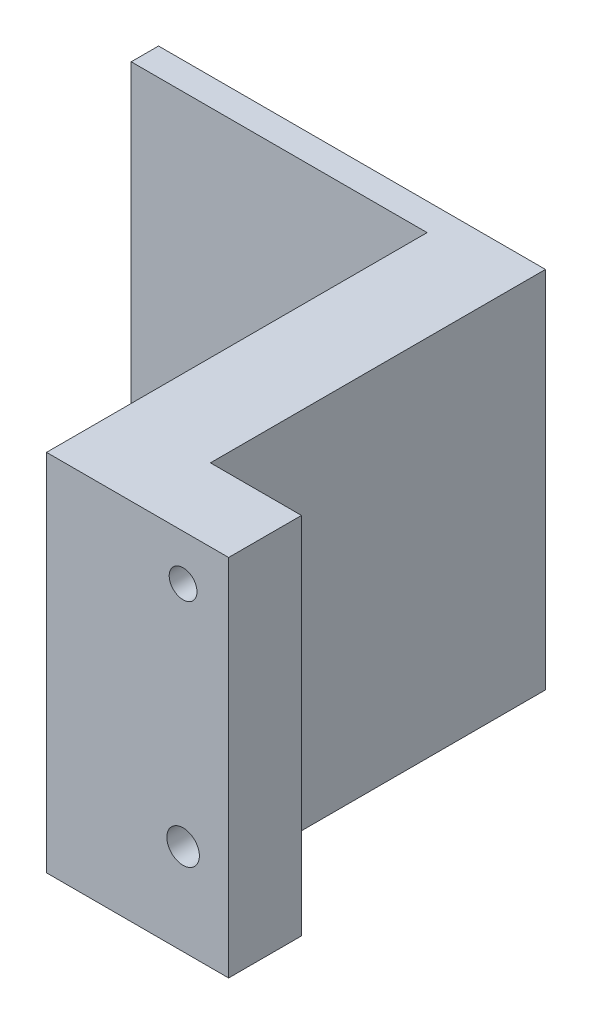
ISO-10303-21;
HEADER;
FILE_DESCRIPTION(('STEP AP214'),'2;1');
FILE_NAME('part.step','',(''),(''),'','','');
FILE_SCHEMA(('AUTOMOTIVE_DESIGN { 1 0 10303 214 1 1 1 1 }'));
ENDSEC;
DATA;
#1=APPLICATION_CONTEXT('core data for automotive mechanical design processes');
#2=APPLICATION_PROTOCOL_DEFINITION('international standard','automotive_design',2000,#1);
#3=PRODUCT_CONTEXT('',#1,'mechanical');
#4=PRODUCT('Part','Part','',(#3));
#5=PRODUCT_RELATED_PRODUCT_CATEGORY('part','',(#4));
#6=PRODUCT_DEFINITION_FORMATION('','',#4);
#7=PRODUCT_DEFINITION_CONTEXT('part definition',#1,'design');
#8=PRODUCT_DEFINITION('design','',#6,#7);
#9=PRODUCT_DEFINITION_SHAPE('','',#8);
#10=(LENGTH_UNIT() NAMED_UNIT(*) SI_UNIT(.MILLI.,.METRE.));
#11=(NAMED_UNIT(*) PLANE_ANGLE_UNIT() SI_UNIT($,.RADIAN.));
#12=(NAMED_UNIT(*) SI_UNIT($,.STERADIAN.) SOLID_ANGLE_UNIT());
#13=UNCERTAINTY_MEASURE_WITH_UNIT(LENGTH_MEASURE(1.E-05),#10,'distance_accuracy_value','');
#14=(GEOMETRIC_REPRESENTATION_CONTEXT(3) GLOBAL_UNCERTAINTY_ASSIGNED_CONTEXT((#13)) GLOBAL_UNIT_ASSIGNED_CONTEXT((#10,
#11,#12)) REPRESENTATION_CONTEXT('',''));
#15=CARTESIAN_POINT('',(0.,0.,0.));
#16=DIRECTION('',(0.,0.,1.));
#17=DIRECTION('',(1.,0.,0.));
#18=AXIS2_PLACEMENT_3D('',#15,#16,#17);
#19=CARTESIAN_POINT('',(0.,0.,0.));
#20=DIRECTION('',(0.,0.,1.));
#21=DIRECTION('',(1.,0.,0.));
#22=AXIS2_PLACEMENT_3D('',#19,#20,#21);
#23=PLANE('',#22);
#24=CARTESIAN_POINT('',(49.9189017309724,2.44231125671822,0.));
#25=DIRECTION('',(0.,0.,1.));
#26=DIRECTION('',(1.,0.,0.));
#27=AXIS2_PLACEMENT_3D('',#24,#25,#26);
#28=CIRCLE('',#27,1.78642085354791);
#29=CARTESIAN_POINT('',(51.7053225845203,2.44231125671822,0.));
#30=VERTEX_POINT('',#29);
#31=EDGE_CURVE('E436',#30,#30,#28,.T.);
#32=ORIENTED_EDGE('',*,*,#31,.T.);
#33=EDGE_LOOP('',(#32));
#34=FACE_BOUND('',#33,.T.);
#35=DIRECTION('',(-0.999940069087134,0.0109479785356853,0.));
#36=VECTOR('',#35,1.);
#37=CARTESIAN_POINT('',(0.0655638957736576,5.98831704463414,0.));
#38=LINE('',#37,#36);
#39=CARTESIAN_POINT('',(51.6836926707623,5.42316900891564,0.));
#40=VERTEX_POINT('',#39);
#41=CARTESIAN_POINT('',(48.2197986623966,5.4610939190436,0.));
#42=VERTEX_POINT('',#41);
#43=EDGE_CURVE('E285',#40,#42,#38,.T.);
#44=ORIENTED_EDGE('',*,*,#43,.F.);
#45=DIRECTION('',(-0.490488807011577,0.871447491359267,0.));
#46=VECTOR('',#45,1.);
#47=CARTESIAN_POINT('',(41.5677211763847,23.3961336421925,0.));
#48=LINE('',#47,#46);
#49=CARTESIAN_POINT('',(53.3827957393381,2.40438634659025,0.));
#50=VERTEX_POINT('',#49);
#51=EDGE_CURVE('E340',#50,#40,#48,.T.);
#52=ORIENTED_EDGE('',*,*,#51,.F.);
#53=DIRECTION('',(0.509451262075557,0.860499512823582,0.));
#54=VECTOR('',#53,1.);
#55=CARTESIAN_POINT('',(38.4737524724558,-22.7780509596798,0.));
#56=LINE('',#55,#54);
#57=CARTESIAN_POINT('',(51.6180047995482,-0.576471405607153,0.));
#58=VERTEX_POINT('',#57);
#59=EDGE_CURVE('E344',#58,#50,#56,.T.);
#60=ORIENTED_EDGE('',*,*,#59,.F.);
#61=DIRECTION('',(0.999940069087134,-0.010947978535685,0.));
#62=VECTOR('',#61,1.);
#63=CARTESIAN_POINT('',(-0.000123975440454096,-0.0113233698886696,0.));
#64=LINE('',#63,#62);
#65=CARTESIAN_POINT('',(48.1541107911825,-0.538546495479193,0.));
#66=VERTEX_POINT('',#65);
#67=EDGE_CURVE('E348',#66,#58,#64,.T.);
#68=ORIENTED_EDGE('',*,*,#67,.F.);
#69=DIRECTION('',(0.490488807011576,-0.871447491359268,0.));
#70=VECTOR('',#69,1.);
#71=CARTESIAN_POINT('',(36.3390362282292,20.453200800123,0.));
#72=LINE('',#71,#70);
#73=CARTESIAN_POINT('',(46.4550077226067,2.48023616684618,0.));
#74=VERTEX_POINT('',#73);
#75=EDGE_CURVE('E352',#74,#66,#72,.T.);
#76=ORIENTED_EDGE('',*,*,#75,.F.);
#77=DIRECTION('',(-0.509451262075557,-0.860499512823582,0.));
#78=VECTOR('',#77,1.);
#79=CARTESIAN_POINT('',(33.3107553955144,-19.7213433872265,0.));
#80=LINE('',#79,#78);
#81=EDGE_CURVE('E356',#42,#74,#80,.T.);
#82=ORIENTED_EDGE('',*,*,#81,.F.);
#83=EDGE_LOOP('',(#44,#52,#60,#68,#76,#82));
#84=FACE_BOUND('',#83,.T.);
#85=ADVANCED_FACE('F95',(#34,#84),#23,.F.);
#86=CARTESIAN_POINT('',(49.9189017309724,27.4423112567182,0.));
#87=DIRECTION('',(0.,0.,1.));
#88=DIRECTION('',(1.,0.,0.));
#89=AXIS2_PLACEMENT_3D('',#86,#87,#88);
#90=CIRCLE('',#89,1.52492957047442);
#91=CARTESIAN_POINT('',(51.4438313014468,27.4423112567182,0.));
#92=VERTEX_POINT('',#91);
#93=EDGE_CURVE('E451',#92,#92,#90,.T.);
#94=ORIENTED_EDGE('',*,*,#93,.T.);
#95=EDGE_LOOP('',(#94));
#96=FACE_BOUND('',#95,.T.);
#97=DIRECTION('',(-0.999940069087134,-0.0109479785356923,0.));
#98=VECTOR('',#97,1.);
#99=CARTESIAN_POINT('',(-0.327280573296135,29.892363965246,0.));
#100=LINE('',#99,#98);
#101=CARTESIAN_POINT('',(51.6180047995482,30.4610939190436,0.));
#102=VERTEX_POINT('',#101);
#103=CARTESIAN_POINT('',(48.1541107911825,30.4231690089156,0.));
#104=VERTEX_POINT('',#103);
#105=EDGE_CURVE('E360',#102,#104,#100,.T.);
#106=ORIENTED_EDGE('',*,*,#105,.F.);
#107=DIRECTION('',(-0.509451262075562,0.860499512823579,0.));
#108=VECTOR('',#107,1.);
#109=CARTESIAN_POINT('',(51.5746498789051,30.5343234718372,0.));
#110=LINE('',#109,#108);
#111=CARTESIAN_POINT('',(53.3827957393381,27.4802361668462,0.));
#112=VERTEX_POINT('',#111);
#113=EDGE_CURVE('E364',#112,#102,#110,.T.);
#114=ORIENTED_EDGE('',*,*,#113,.F.);
#115=DIRECTION('',(0.490488807011566,0.871447491359273,0.));
#116=VECTOR('',#115,1.);
#117=CARTESIAN_POINT('',(28.7939803677915,-16.2065129795525,0.));
#118=LINE('',#117,#116);
#119=CARTESIAN_POINT('',(51.6836926707624,24.4614535045208,0.));
#120=VERTEX_POINT('',#119);
#121=EDGE_CURVE('E368',#120,#112,#118,.T.);
#122=ORIENTED_EDGE('',*,*,#121,.F.);
#123=DIRECTION('',(0.999940069087134,0.0109479785356933,0.));
#124=VECTOR('',#123,1.);
#125=CARTESIAN_POINT('',(-0.261592702082006,23.8927235507231,0.));
#126=LINE('',#125,#124);
#127=CARTESIAN_POINT('',(48.2197986623967,24.4235285943928,0.));
#128=VERTEX_POINT('',#127);
#129=EDGE_CURVE('E372',#128,#120,#126,.T.);
#130=ORIENTED_EDGE('',*,*,#129,.F.);
#131=DIRECTION('',(0.509451262075565,-0.860499512823578,0.));
#132=VECTOR('',#131,1.);
#133=CARTESIAN_POINT('',(46.4116528019635,27.4776158993839,0.));
#134=LINE('',#133,#132);
#135=CARTESIAN_POINT('',(46.4550077226067,27.4043863465902,0.));
#136=VERTEX_POINT('',#135);
#137=EDGE_CURVE('E376',#136,#128,#134,.T.);
#138=ORIENTED_EDGE('',*,*,#137,.F.);
#139=DIRECTION('',(-0.490488807011569,-0.871447491359272,0.));
#140=VECTOR('',#139,1.);
#141=CARTESIAN_POINT('',(23.5652954196357,-13.2635801374831,0.));
#142=LINE('',#141,#140);
#143=EDGE_CURVE('E294',#104,#136,#142,.T.);
#144=ORIENTED_EDGE('',*,*,#143,.F.);
#145=EDGE_LOOP('',(#106,#114,#122,#130,#138,#144));
#146=FACE_BOUND('',#145,.T.);
#147=ADVANCED_FACE('F505',(#96,#146),#23,.F.);
#148=CARTESIAN_POINT('',(0.,-7.55768874328178,5.));
#149=DIRECTION('',(0.,1.,0.));
#150=DIRECTION('',(0.,0.,1.));
#151=AXIS2_PLACEMENT_3D('',#148,#149,#150);
#152=PLANE('',#151);
#153=DIRECTION('',(0.,0.,-1.));
#154=VECTOR('',#153,1.);
#155=CARTESIAN_POINT('',(54.9189017309724,-7.55768874328178,5.));
#156=LINE('',#155,#154);
#157=CARTESIAN_POINT('',(54.9189017309724,-7.55768874328178,5.));
#158=VERTEX_POINT('',#157);
#159=CARTESIAN_POINT('',(54.9189017309724,-7.55768874328178,-3.));
#160=VERTEX_POINT('',#159);
#161=EDGE_CURVE('E104',#158,#160,#156,.T.);
#162=ORIENTED_EDGE('',*,*,#161,.F.);
#163=DIRECTION('',(1.,0.,0.));
#164=VECTOR('',#163,1.);
#165=CARTESIAN_POINT('',(0.,-7.55768874328178,5.));
#166=LINE('',#165,#164);
#167=CARTESIAN_POINT('',(34.9189017309724,-7.55768874328178,5.));
#168=VERTEX_POINT('',#167);
#169=EDGE_CURVE('E435',#168,#158,#166,.T.);
#170=ORIENTED_EDGE('',*,*,#169,.F.);
#171=DIRECTION('',(0.,0.,-1.));
#172=VECTOR('',#171,1.);
#173=CARTESIAN_POINT('',(34.9189017309724,-7.55768874328178,5.));
#174=LINE('',#173,#172);
#175=CARTESIAN_POINT('',(34.9189017309724,-7.55768874328178,-36.8));
#176=VERTEX_POINT('',#175);
#177=EDGE_CURVE('E468',#168,#176,#174,.T.);
#178=ORIENTED_EDGE('',*,*,#177,.T.);
#179=DIRECTION('',(-1.,0.,0.));
#180=VECTOR('',#179,1.);
#181=CARTESIAN_POINT('',(0.,-7.55768874328179,-36.8));
#182=LINE('',#181,#180);
#183=CARTESIAN_POINT('',(2.41890173097244,-7.55768874328179,-36.8));
#184=VERTEX_POINT('',#183);
#185=EDGE_CURVE('E111',#176,#184,#182,.T.);
#186=ORIENTED_EDGE('',*,*,#185,.T.);
#187=DIRECTION('',(0.,0.,-1.));
#188=VECTOR('',#187,1.);
#189=CARTESIAN_POINT('',(2.41890173097244,-7.55768874328179,-36.8));
#190=LINE('',#189,#188);
#191=CARTESIAN_POINT('',(2.41890173097244,-7.55768874328179,-39.8));
#192=VERTEX_POINT('',#191);
#193=EDGE_CURVE('E255',#184,#192,#190,.T.);
#194=ORIENTED_EDGE('',*,*,#193,.T.);
#195=DIRECTION('',(-1.,0.,0.));
#196=VECTOR('',#195,1.);
#197=CARTESIAN_POINT('',(0.,-7.55768874328178,-39.8));
#198=LINE('',#197,#196);
#199=CARTESIAN_POINT('',(44.9189017309724,-7.55768874328179,-39.8));
#200=VERTEX_POINT('',#199);
#201=EDGE_CURVE('E277',#200,#192,#198,.T.);
#202=ORIENTED_EDGE('',*,*,#201,.F.);
#203=DIRECTION('',(0.,0.,1.));
#204=VECTOR('',#203,1.);
#205=CARTESIAN_POINT('',(44.9189017309724,-7.55768874328179,-39.8));
#206=LINE('',#205,#204);
#207=CARTESIAN_POINT('',(44.9189017309724,-7.55768874328179,-3.));
#208=VERTEX_POINT('',#207);
#209=EDGE_CURVE('E281',#200,#208,#206,.T.);
#210=ORIENTED_EDGE('',*,*,#209,.T.);
#211=DIRECTION('',(1.,0.,0.));
#212=VECTOR('',#211,1.);
#213=CARTESIAN_POINT('',(0.,-7.55768874328181,-3.));
#214=LINE('',#213,#212);
#215=EDGE_CURVE('E118',#208,#160,#214,.T.);
#216=ORIENTED_EDGE('',*,*,#215,.T.);
#217=EDGE_LOOP('',(#162,#170,#178,#186,#194,#202,#210,#216));
#218=FACE_BOUND('',#217,.T.);
#219=ADVANCED_FACE('F475',(#218),#152,.F.);
#220=CARTESIAN_POINT('',(54.9189017309724,0.,5.));
#221=DIRECTION('',(1.,0.,0.));
#222=DIRECTION('',(0.,1.,0.));
#223=AXIS2_PLACEMENT_3D('',#220,#221,#222);
#224=PLANE('',#223);
#225=ORIENTED_EDGE('',*,*,#161,.T.);
#226=DIRECTION('',(0.,-1.,0.));
#227=VECTOR('',#226,1.);
#228=CARTESIAN_POINT('',(54.9189017309724,0.,-3.));
#229=LINE('',#228,#227);
#230=CARTESIAN_POINT('',(54.9189017309724,32.4423112567182,-3.));
#231=VERTEX_POINT('',#230);
#232=EDGE_CURVE('E328',#231,#160,#229,.T.);
#233=ORIENTED_EDGE('',*,*,#232,.F.);
#234=DIRECTION('',(0.,0.,-1.));
#235=VECTOR('',#234,1.);
#236=CARTESIAN_POINT('',(54.9189017309724,32.4423112567182,5.));
#237=LINE('',#236,#235);
#238=CARTESIAN_POINT('',(54.9189017309724,32.4423112567182,5.));
#239=VERTEX_POINT('',#238);
#240=EDGE_CURVE('E450',#239,#231,#237,.T.);
#241=ORIENTED_EDGE('',*,*,#240,.F.);
#242=DIRECTION('',(0.,-1.,0.));
#243=VECTOR('',#242,1.);
#244=CARTESIAN_POINT('',(54.9189017309724,0.,5.));
#245=LINE('',#244,#243);
#246=EDGE_CURVE('E439',#239,#158,#245,.T.);
#247=ORIENTED_EDGE('',*,*,#246,.T.);
#248=EDGE_LOOP('',(#225,#233,#241,#247));
#249=FACE_BOUND('',#248,.T.);
#250=ADVANCED_FACE('F483',(#249),#224,.T.);
#251=CARTESIAN_POINT('',(0.,32.4423112567182,5.));
#252=DIRECTION('',(0.,1.,0.));
#253=DIRECTION('',(0.,0.,1.));
#254=AXIS2_PLACEMENT_3D('',#251,#252,#253);
#255=PLANE('',#254);
#256=DIRECTION('',(1.,0.,0.));
#257=VECTOR('',#256,1.);
#258=CARTESIAN_POINT('',(0.,32.4423112567182,-3.));
#259=LINE('',#258,#257);
#260=CARTESIAN_POINT('',(44.9189017309724,32.4423112567182,-3.));
#261=VERTEX_POINT('',#260);
#262=EDGE_CURVE('E331',#261,#231,#259,.T.);
#263=ORIENTED_EDGE('',*,*,#262,.F.);
#264=DIRECTION('',(0.,0.,1.));
#265=VECTOR('',#264,1.);
#266=CARTESIAN_POINT('',(44.9189017309724,32.4423112567182,-39.8));
#267=LINE('',#266,#265);
#268=CARTESIAN_POINT('',(44.9189017309724,32.4423112567182,-39.8));
#269=VERTEX_POINT('',#268);
#270=EDGE_CURVE('E280',#269,#261,#267,.T.);
#271=ORIENTED_EDGE('',*,*,#270,.F.);
#272=DIRECTION('',(-1.,0.,0.));
#273=VECTOR('',#272,1.);
#274=CARTESIAN_POINT('',(0.,32.4423112567182,-39.8));
#275=LINE('',#274,#273);
#276=CARTESIAN_POINT('',(2.41890173097244,32.4423112567182,-39.8));
#277=VERTEX_POINT('',#276);
#278=EDGE_CURVE('E249',#269,#277,#275,.T.);
#279=ORIENTED_EDGE('',*,*,#278,.T.);
#280=DIRECTION('',(0.,0.,-1.));
#281=VECTOR('',#280,1.);
#282=CARTESIAN_POINT('',(2.41890173097244,32.4423112567182,-36.8));
#283=LINE('',#282,#281);
#284=CARTESIAN_POINT('',(2.41890173097244,32.4423112567182,-36.8));
#285=VERTEX_POINT('',#284);
#286=EDGE_CURVE('E246',#285,#277,#283,.T.);
#287=ORIENTED_EDGE('',*,*,#286,.F.);
#288=DIRECTION('',(-1.,0.,0.));
#289=VECTOR('',#288,1.);
#290=CARTESIAN_POINT('',(0.,32.4423112567182,-36.8));
#291=LINE('',#290,#289);
#292=CARTESIAN_POINT('',(34.9189017309724,32.4423112567182,-36.8));
#293=VERTEX_POINT('',#292);
#294=EDGE_CURVE('E232',#293,#285,#291,.T.);
#295=ORIENTED_EDGE('',*,*,#294,.F.);
#296=DIRECTION('',(0.,0.,-1.));
#297=VECTOR('',#296,1.);
#298=CARTESIAN_POINT('',(34.9189017309724,32.4423112567182,5.));
#299=LINE('',#298,#297);
#300=CARTESIAN_POINT('',(34.9189017309724,32.4423112567182,5.));
#301=VERTEX_POINT('',#300);
#302=EDGE_CURVE('E455',#301,#293,#299,.T.);
#303=ORIENTED_EDGE('',*,*,#302,.F.);
#304=DIRECTION('',(1.,0.,0.));
#305=VECTOR('',#304,1.);
#306=CARTESIAN_POINT('',(0.,32.4423112567182,5.));
#307=LINE('',#306,#305);
#308=EDGE_CURVE('E443',#301,#239,#307,.T.);
#309=ORIENTED_EDGE('',*,*,#308,.T.);
#310=ORIENTED_EDGE('',*,*,#240,.T.);
#311=EDGE_LOOP('',(#263,#271,#279,#287,#295,#303,#309,#310));
#312=FACE_BOUND('',#311,.T.);
#313=ADVANCED_FACE('F247',(#312),#255,.T.);
#314=CARTESIAN_POINT('',(49.9189017309724,27.4423112567182,5.));
#315=DIRECTION('',(0.,0.,-1.));
#316=DIRECTION('',(-1.,0.,0.));
#317=AXIS2_PLACEMENT_3D('',#314,#315,#316);
#318=CYLINDRICAL_SURFACE('',#317,1.52492957047442);
#319=CARTESIAN_POINT('',(49.9189017309724,27.4423112567182,5.));
#320=DIRECTION('',(0.,0.,1.));
#321=DIRECTION('',(1.,0.,0.));
#322=AXIS2_PLACEMENT_3D('',#319,#320,#321);
#323=CIRCLE('',#322,1.52492957047442);
#324=CARTESIAN_POINT('',(51.4438313014468,27.4423112567182,5.));
#325=VERTEX_POINT('',#324);
#326=EDGE_CURVE('E431',#325,#325,#323,.T.);
#327=ORIENTED_EDGE('',*,*,#326,.T.);
#328=EDGE_LOOP('',(#327));
#329=FACE_BOUND('',#328,.T.);
#330=ORIENTED_EDGE('',*,*,#93,.F.);
#331=EDGE_LOOP('',(#330));
#332=FACE_BOUND('',#331,.T.);
#333=ADVANCED_FACE('F519',(#329,#332),#318,.F.);
#334=CARTESIAN_POINT('',(49.9189017309724,2.44231125671822,5.));
#335=DIRECTION('',(0.,0.,-1.));
#336=DIRECTION('',(-1.,0.,0.));
#337=AXIS2_PLACEMENT_3D('',#334,#335,#336);
#338=CYLINDRICAL_SURFACE('',#337,1.78642085354791);
#339=CARTESIAN_POINT('',(49.9189017309724,2.44231125671822,5.));
#340=DIRECTION('',(0.,0.,1.));
#341=DIRECTION('',(1.,0.,0.));
#342=AXIS2_PLACEMENT_3D('',#339,#340,#341);
#343=CIRCLE('',#342,1.78642085354791);
#344=CARTESIAN_POINT('',(51.7053225845203,2.44231125671822,5.));
#345=VERTEX_POINT('',#344);
#346=EDGE_CURVE('E446',#345,#345,#343,.T.);
#347=ORIENTED_EDGE('',*,*,#346,.T.);
#348=EDGE_LOOP('',(#347));
#349=FACE_BOUND('',#348,.T.);
#350=ORIENTED_EDGE('',*,*,#31,.F.);
#351=EDGE_LOOP('',(#350));
#352=FACE_BOUND('',#351,.T.);
#353=ADVANCED_FACE('F516',(#349,#352),#338,.F.);
#354=CARTESIAN_POINT('',(0.,0.,5.));
#355=DIRECTION('',(0.,0.,1.));
#356=DIRECTION('',(1.,0.,0.));
#357=AXIS2_PLACEMENT_3D('',#354,#355,#356);
#358=PLANE('',#357);
#359=ORIENTED_EDGE('',*,*,#246,.F.);
#360=ORIENTED_EDGE('',*,*,#308,.F.);
#361=DIRECTION('',(0.,-1.,0.));
#362=VECTOR('',#361,1.);
#363=CARTESIAN_POINT('',(34.9189017309724,32.4423112567182,5.));
#364=LINE('',#363,#362);
#365=EDGE_CURVE('E387',#301,#168,#364,.T.);
#366=ORIENTED_EDGE('',*,*,#365,.T.);
#367=ORIENTED_EDGE('',*,*,#169,.T.);
#368=EDGE_LOOP('',(#359,#360,#366,#367));
#369=FACE_BOUND('',#368,.T.);
#370=ORIENTED_EDGE('',*,*,#326,.F.);
#371=EDGE_LOOP('',(#370));
#372=FACE_BOUND('',#371,.T.);
#373=ORIENTED_EDGE('',*,*,#346,.F.);
#374=EDGE_LOOP('',(#373));
#375=FACE_BOUND('',#374,.T.);
#376=ADVANCED_FACE('F484',(#369,#372,#375),#358,.T.);
#377=CARTESIAN_POINT('',(34.9189017309724,32.4423112567182,5.));
#378=DIRECTION('',(1.,0.,0.));
#379=DIRECTION('',(0.,0.,-1.));
#380=AXIS2_PLACEMENT_3D('',#377,#378,#379);
#381=PLANE('',#380);
#382=ORIENTED_EDGE('',*,*,#302,.T.);
#383=DIRECTION('',(0.,-1.,0.));
#384=VECTOR('',#383,1.);
#385=CARTESIAN_POINT('',(34.9189017309724,0.,-36.8));
#386=LINE('',#385,#384);
#387=EDGE_CURVE('E238',#293,#176,#386,.T.);
#388=ORIENTED_EDGE('',*,*,#387,.T.);
#389=ORIENTED_EDGE('',*,*,#177,.F.);
#390=ORIENTED_EDGE('',*,*,#365,.F.);
#391=EDGE_LOOP('',(#382,#388,#389,#390));
#392=FACE_BOUND('',#391,.T.);
#393=ADVANCED_FACE('F97',(#392),#381,.F.);
#394=CARTESIAN_POINT('',(-0.327280573296135,29.892363965246,-3.));
#395=DIRECTION('',(-0.0109479785356923,0.999940069087134,0.));
#396=DIRECTION('',(-0.999940069087134,-0.0109479785356923,0.));
#397=AXIS2_PLACEMENT_3D('',#394,#395,#396);
#398=PLANE('',#397);
#399=ORIENTED_EDGE('',*,*,#105,.T.);
#400=DIRECTION('',(0.,0.,1.));
#401=VECTOR('',#400,1.);
#402=CARTESIAN_POINT('',(48.1541107911825,30.4231690089156,-3.));
#403=LINE('',#402,#401);
#404=CARTESIAN_POINT('',(48.1541107911825,30.4231690089156,-3.));
#405=VERTEX_POINT('',#404);
#406=EDGE_CURVE('E383',#405,#104,#403,.T.);
#407=ORIENTED_EDGE('',*,*,#406,.F.);
#408=DIRECTION('',(-0.999940069087134,-0.0109479785356923,0.));
#409=VECTOR('',#408,1.);
#410=CARTESIAN_POINT('',(-0.327280573296135,29.892363965246,-3.));
#411=LINE('',#410,#409);
#412=CARTESIAN_POINT('',(51.6180047995482,30.4610939190436,-3.));
#413=VERTEX_POINT('',#412);
#414=EDGE_CURVE('E309',#413,#405,#411,.T.);
#415=ORIENTED_EDGE('',*,*,#414,.F.);
#416=DIRECTION('',(0.,0.,1.));
#417=VECTOR('',#416,1.);
#418=CARTESIAN_POINT('',(51.6180047995482,30.4610939190436,-3.));
#419=LINE('',#418,#417);
#420=EDGE_CURVE('E404',#413,#102,#419,.T.);
#421=ORIENTED_EDGE('',*,*,#420,.T.);
#422=EDGE_LOOP('',(#399,#407,#415,#421));
#423=FACE_BOUND('',#422,.T.);
#424=ADVANCED_FACE('F542',(#423),#398,.F.);
#425=CARTESIAN_POINT('',(23.5652954196357,-13.2635801374831,-3.));
#426=DIRECTION('',(-0.871447491359272,0.490488807011569,0.));
#427=DIRECTION('',(-0.490488807011569,-0.871447491359272,0.));
#428=AXIS2_PLACEMENT_3D('',#425,#426,#427);
#429=PLANE('',#428);
#430=ORIENTED_EDGE('',*,*,#143,.T.);
#431=DIRECTION('',(0.,0.,1.));
#432=VECTOR('',#431,1.);
#433=CARTESIAN_POINT('',(46.4550077226067,27.4043863465902,-3.));
#434=LINE('',#433,#432);
#435=CARTESIAN_POINT('',(46.4550077226067,27.4043863465902,-3.));
#436=VERTEX_POINT('',#435);
#437=EDGE_CURVE('E388',#436,#136,#434,.T.);
#438=ORIENTED_EDGE('',*,*,#437,.F.);
#439=DIRECTION('',(-0.490488807011569,-0.871447491359272,0.));
#440=VECTOR('',#439,1.);
#441=CARTESIAN_POINT('',(23.5652954196357,-13.2635801374831,-3.));
#442=LINE('',#441,#440);
#443=EDGE_CURVE('E325',#405,#436,#442,.T.);
#444=ORIENTED_EDGE('',*,*,#443,.F.);
#445=ORIENTED_EDGE('',*,*,#406,.T.);
#446=EDGE_LOOP('',(#430,#438,#444,#445));
#447=FACE_BOUND('',#446,.T.);
#448=ADVANCED_FACE('F557',(#447),#429,.F.);
#449=CARTESIAN_POINT('',(46.4116528019635,27.4776158993839,-3.));
#450=DIRECTION('',(-0.860499512823578,-0.509451262075565,0.));
#451=DIRECTION('',(0.509451262075565,-0.860499512823578,0.));
#452=AXIS2_PLACEMENT_3D('',#449,#450,#451);
#453=PLANE('',#452);
#454=ORIENTED_EDGE('',*,*,#137,.T.);
#455=DIRECTION('',(0.,0.,1.));
#456=VECTOR('',#455,1.);
#457=CARTESIAN_POINT('',(48.2197986623967,24.4235285943928,-3.));
#458=LINE('',#457,#456);
#459=CARTESIAN_POINT('',(48.2197986623967,24.4235285943928,-3.));
#460=VERTEX_POINT('',#459);
#461=EDGE_CURVE('E392',#460,#128,#458,.T.);
#462=ORIENTED_EDGE('',*,*,#461,.F.);
#463=DIRECTION('',(0.509451262075565,-0.860499512823578,0.));
#464=VECTOR('',#463,1.);
#465=CARTESIAN_POINT('',(46.4116528019635,27.4776158993839,-3.));
#466=LINE('',#465,#464);
#467=EDGE_CURVE('E322',#436,#460,#466,.T.);
#468=ORIENTED_EDGE('',*,*,#467,.F.);
#469=ORIENTED_EDGE('',*,*,#437,.T.);
#470=EDGE_LOOP('',(#454,#462,#468,#469));
#471=FACE_BOUND('',#470,.T.);
#472=ADVANCED_FACE('F555',(#471),#453,.F.);
#473=CARTESIAN_POINT('',(-0.261592702082006,23.8927235507231,-3.));
#474=DIRECTION('',(0.0109479785356933,-0.999940069087134,0.));
#475=DIRECTION('',(0.999940069087134,0.0109479785356933,0.));
#476=AXIS2_PLACEMENT_3D('',#473,#474,#475);
#477=PLANE('',#476);
#478=ORIENTED_EDGE('',*,*,#129,.T.);
#479=DIRECTION('',(0.,0.,1.));
#480=VECTOR('',#479,1.);
#481=CARTESIAN_POINT('',(51.6836926707624,24.4614535045208,-3.));
#482=LINE('',#481,#480);
#483=CARTESIAN_POINT('',(51.6836926707624,24.4614535045208,-3.));
#484=VERTEX_POINT('',#483);
#485=EDGE_CURVE('E396',#484,#120,#482,.T.);
#486=ORIENTED_EDGE('',*,*,#485,.F.);
#487=DIRECTION('',(0.999940069087134,0.0109479785356933,0.));
#488=VECTOR('',#487,1.);
#489=CARTESIAN_POINT('',(-0.261592702082006,23.8927235507231,-3.));
#490=LINE('',#489,#488);
#491=EDGE_CURVE('E319',#460,#484,#490,.T.);
#492=ORIENTED_EDGE('',*,*,#491,.F.);
#493=ORIENTED_EDGE('',*,*,#461,.T.);
#494=EDGE_LOOP('',(#478,#486,#492,#493));
#495=FACE_BOUND('',#494,.T.);
#496=ADVANCED_FACE('F551',(#495),#477,.F.);
#497=CARTESIAN_POINT('',(28.7939803677915,-16.2065129795525,-3.));
#498=DIRECTION('',(0.871447491359273,-0.490488807011566,0.));
#499=DIRECTION('',(0.490488807011566,0.871447491359273,0.));
#500=AXIS2_PLACEMENT_3D('',#497,#498,#499);
#501=PLANE('',#500);
#502=ORIENTED_EDGE('',*,*,#121,.T.);
#503=DIRECTION('',(0.,0.,1.));
#504=VECTOR('',#503,1.);
#505=CARTESIAN_POINT('',(53.3827957393381,27.4802361668462,-3.));
#506=LINE('',#505,#504);
#507=CARTESIAN_POINT('',(53.3827957393381,27.4802361668462,-3.));
#508=VERTEX_POINT('',#507);
#509=EDGE_CURVE('E400',#508,#112,#506,.T.);
#510=ORIENTED_EDGE('',*,*,#509,.F.);
#511=DIRECTION('',(0.490488807011566,0.871447491359273,0.));
#512=VECTOR('',#511,1.);
#513=CARTESIAN_POINT('',(28.7939803677915,-16.2065129795525,-3.));
#514=LINE('',#513,#512);
#515=EDGE_CURVE('E316',#484,#508,#514,.T.);
#516=ORIENTED_EDGE('',*,*,#515,.F.);
#517=ORIENTED_EDGE('',*,*,#485,.T.);
#518=EDGE_LOOP('',(#502,#510,#516,#517));
#519=FACE_BOUND('',#518,.T.);
#520=ADVANCED_FACE('F549',(#519),#501,.F.);
#521=CARTESIAN_POINT('',(0.0655638957736576,5.98831704463414,-3.));
#522=DIRECTION('',(0.0109479785356853,0.999940069087134,0.));
#523=DIRECTION('',(-0.999940069087134,0.0109479785356853,0.));
#524=AXIS2_PLACEMENT_3D('',#521,#522,#523);
#525=PLANE('',#524);
#526=ORIENTED_EDGE('',*,*,#43,.T.);
#527=DIRECTION('',(0.,0.,1.));
#528=VECTOR('',#527,1.);
#529=CARTESIAN_POINT('',(48.2197986623966,5.4610939190436,-3.));
#530=LINE('',#529,#528);
#531=CARTESIAN_POINT('',(48.2197986623966,5.4610939190436,-3.));
#532=VERTEX_POINT('',#531);
#533=EDGE_CURVE('E408',#532,#42,#530,.T.);
#534=ORIENTED_EDGE('',*,*,#533,.F.);
#535=DIRECTION('',(-0.999940069087134,0.0109479785356853,0.));
#536=VECTOR('',#535,1.);
#537=CARTESIAN_POINT('',(0.0655638957736576,5.98831704463414,-3.));
#538=LINE('',#537,#536);
#539=CARTESIAN_POINT('',(51.6836926707623,5.42316900891564,-3.));
#540=VERTEX_POINT('',#539);
#541=EDGE_CURVE('E289',#540,#532,#538,.T.);
#542=ORIENTED_EDGE('',*,*,#541,.F.);
#543=DIRECTION('',(0.,0.,1.));
#544=VECTOR('',#543,1.);
#545=CARTESIAN_POINT('',(51.6836926707623,5.42316900891564,-3.));
#546=LINE('',#545,#544);
#547=EDGE_CURVE('E336',#540,#40,#546,.T.);
#548=ORIENTED_EDGE('',*,*,#547,.T.);
#549=EDGE_LOOP('',(#526,#534,#542,#548));
#550=FACE_BOUND('',#549,.T.);
#551=ADVANCED_FACE('F571',(#550),#525,.F.);
#552=CARTESIAN_POINT('',(33.3107553955144,-19.7213433872265,-3.));
#553=DIRECTION('',(-0.860499512823582,0.509451262075557,0.));
#554=DIRECTION('',(-0.509451262075557,-0.860499512823582,0.));
#555=AXIS2_PLACEMENT_3D('',#552,#553,#554);
#556=PLANE('',#555);
#557=ORIENTED_EDGE('',*,*,#81,.T.);
#558=DIRECTION('',(0.,0.,1.));
#559=VECTOR('',#558,1.);
#560=CARTESIAN_POINT('',(46.4550077226067,2.48023616684618,-3.));
#561=LINE('',#560,#559);
#562=CARTESIAN_POINT('',(46.4550077226067,2.48023616684618,-3.));
#563=VERTEX_POINT('',#562);
#564=EDGE_CURVE('E412',#563,#74,#561,.T.);
#565=ORIENTED_EDGE('',*,*,#564,.F.);
#566=DIRECTION('',(-0.509451262075557,-0.860499512823582,0.));
#567=VECTOR('',#566,1.);
#568=CARTESIAN_POINT('',(33.3107553955144,-19.7213433872265,-3.));
#569=LINE('',#568,#567);
#570=EDGE_CURVE('E306',#532,#563,#569,.T.);
#571=ORIENTED_EDGE('',*,*,#570,.F.);
#572=ORIENTED_EDGE('',*,*,#533,.T.);
#573=EDGE_LOOP('',(#557,#565,#571,#572));
#574=FACE_BOUND('',#573,.T.);
#575=ADVANCED_FACE('F575',(#574),#556,.F.);
#576=CARTESIAN_POINT('',(36.3390362282292,20.453200800123,-3.));
#577=DIRECTION('',(-0.871447491359268,-0.490488807011576,0.));
#578=DIRECTION('',(0.490488807011576,-0.871447491359268,0.));
#579=AXIS2_PLACEMENT_3D('',#576,#577,#578);
#580=PLANE('',#579);
#581=ORIENTED_EDGE('',*,*,#75,.T.);
#582=DIRECTION('',(0.,0.,1.));
#583=VECTOR('',#582,1.);
#584=CARTESIAN_POINT('',(48.1541107911825,-0.538546495479193,-3.));
#585=LINE('',#584,#583);
#586=CARTESIAN_POINT('',(48.1541107911825,-0.538546495479193,-3.));
#587=VERTEX_POINT('',#586);
#588=EDGE_CURVE('E416',#587,#66,#585,.T.);
#589=ORIENTED_EDGE('',*,*,#588,.F.);
#590=DIRECTION('',(0.490488807011576,-0.871447491359268,0.));
#591=VECTOR('',#590,1.);
#592=CARTESIAN_POINT('',(36.3390362282292,20.453200800123,-3.));
#593=LINE('',#592,#591);
#594=EDGE_CURVE('E303',#563,#587,#593,.T.);
#595=ORIENTED_EDGE('',*,*,#594,.F.);
#596=ORIENTED_EDGE('',*,*,#564,.T.);
#597=EDGE_LOOP('',(#581,#589,#595,#596));
#598=FACE_BOUND('',#597,.T.);
#599=ADVANCED_FACE('F578',(#598),#580,.F.);
#600=CARTESIAN_POINT('',(-0.000123975440454096,-0.0113233698886696,-3.));
#601=DIRECTION('',(-0.010947978535685,-0.999940069087134,0.));
#602=DIRECTION('',(0.999940069087134,-0.010947978535685,0.));
#603=AXIS2_PLACEMENT_3D('',#600,#601,#602);
#604=PLANE('',#603);
#605=ORIENTED_EDGE('',*,*,#67,.T.);
#606=DIRECTION('',(0.,0.,1.));
#607=VECTOR('',#606,1.);
#608=CARTESIAN_POINT('',(51.6180047995482,-0.576471405607153,-3.));
#609=LINE('',#608,#607);
#610=CARTESIAN_POINT('',(51.6180047995482,-0.576471405607153,-3.));
#611=VERTEX_POINT('',#610);
#612=EDGE_CURVE('E420',#611,#58,#609,.T.);
#613=ORIENTED_EDGE('',*,*,#612,.F.);
#614=DIRECTION('',(0.999940069087134,-0.010947978535685,0.));
#615=VECTOR('',#614,1.);
#616=CARTESIAN_POINT('',(-0.000123975440454096,-0.0113233698886696,-3.));
#617=LINE('',#616,#615);
#618=EDGE_CURVE('E300',#587,#611,#617,.T.);
#619=ORIENTED_EDGE('',*,*,#618,.F.);
#620=ORIENTED_EDGE('',*,*,#588,.T.);
#621=EDGE_LOOP('',(#605,#613,#619,#620));
#622=FACE_BOUND('',#621,.T.);
#623=ADVANCED_FACE('F582',(#622),#604,.F.);
#624=CARTESIAN_POINT('',(38.4737524724558,-22.7780509596798,-3.));
#625=DIRECTION('',(0.860499512823582,-0.509451262075557,0.));
#626=DIRECTION('',(0.509451262075557,0.860499512823582,0.));
#627=AXIS2_PLACEMENT_3D('',#624,#625,#626);
#628=PLANE('',#627);
#629=ORIENTED_EDGE('',*,*,#59,.T.);
#630=DIRECTION('',(0.,0.,1.));
#631=VECTOR('',#630,1.);
#632=CARTESIAN_POINT('',(53.3827957393381,2.40438634659025,-3.));
#633=LINE('',#632,#631);
#634=CARTESIAN_POINT('',(53.3827957393381,2.40438634659025,-3.));
#635=VERTEX_POINT('',#634);
#636=EDGE_CURVE('E424',#635,#50,#633,.T.);
#637=ORIENTED_EDGE('',*,*,#636,.F.);
#638=DIRECTION('',(0.509451262075557,0.860499512823582,0.));
#639=VECTOR('',#638,1.);
#640=CARTESIAN_POINT('',(38.4737524724558,-22.7780509596798,-3.));
#641=LINE('',#640,#639);
#642=EDGE_CURVE('E297',#611,#635,#641,.T.);
#643=ORIENTED_EDGE('',*,*,#642,.F.);
#644=ORIENTED_EDGE('',*,*,#612,.T.);
#645=EDGE_LOOP('',(#629,#637,#643,#644));
#646=FACE_BOUND('',#645,.T.);
#647=ADVANCED_FACE('F573',(#646),#628,.F.);
#648=CARTESIAN_POINT('',(51.5746498789051,30.5343234718372,-3.));
#649=DIRECTION('',(0.860499512823579,0.509451262075562,0.));
#650=DIRECTION('',(-0.509451262075562,0.860499512823579,0.));
#651=AXIS2_PLACEMENT_3D('',#648,#649,#650);
#652=PLANE('',#651);
#653=ORIENTED_EDGE('',*,*,#113,.T.);
#654=ORIENTED_EDGE('',*,*,#420,.F.);
#655=DIRECTION('',(-0.509451262075562,0.860499512823579,0.));
#656=VECTOR('',#655,1.);
#657=CARTESIAN_POINT('',(51.5746498789051,30.5343234718372,-3.));
#658=LINE('',#657,#656);
#659=EDGE_CURVE('E313',#508,#413,#658,.T.);
#660=ORIENTED_EDGE('',*,*,#659,.F.);
#661=ORIENTED_EDGE('',*,*,#509,.T.);
#662=EDGE_LOOP('',(#653,#654,#660,#661));
#663=FACE_BOUND('',#662,.T.);
#664=ADVANCED_FACE('F538',(#663),#652,.F.);
#665=CARTESIAN_POINT('',(41.5677211763847,23.3961336421925,-3.));
#666=DIRECTION('',(0.871447491359267,0.490488807011577,0.));
#667=DIRECTION('',(-0.490488807011577,0.871447491359267,0.));
#668=AXIS2_PLACEMENT_3D('',#665,#666,#667);
#669=PLANE('',#668);
#670=ORIENTED_EDGE('',*,*,#51,.T.);
#671=ORIENTED_EDGE('',*,*,#547,.F.);
#672=DIRECTION('',(-0.490488807011577,0.871447491359267,0.));
#673=VECTOR('',#672,1.);
#674=CARTESIAN_POINT('',(41.5677211763847,23.3961336421925,-3.));
#675=LINE('',#674,#673);
#676=EDGE_CURVE('E293',#635,#540,#675,.T.);
#677=ORIENTED_EDGE('',*,*,#676,.F.);
#678=ORIENTED_EDGE('',*,*,#636,.T.);
#679=EDGE_LOOP('',(#670,#671,#677,#678));
#680=FACE_BOUND('',#679,.T.);
#681=ADVANCED_FACE('F501',(#680),#669,.F.);
#682=CARTESIAN_POINT('',(0.,0.,-3.));
#683=DIRECTION('',(0.,0.,1.));
#684=DIRECTION('',(1.,0.,0.));
#685=AXIS2_PLACEMENT_3D('',#682,#683,#684);
#686=PLANE('',#685);
#687=ORIENTED_EDGE('',*,*,#541,.T.);
#688=ORIENTED_EDGE('',*,*,#570,.T.);
#689=ORIENTED_EDGE('',*,*,#594,.T.);
#690=ORIENTED_EDGE('',*,*,#618,.T.);
#691=ORIENTED_EDGE('',*,*,#642,.T.);
#692=ORIENTED_EDGE('',*,*,#676,.T.);
#693=EDGE_LOOP('',(#687,#688,#689,#690,#691,#692));
#694=FACE_BOUND('',#693,.T.);
#695=ORIENTED_EDGE('',*,*,#414,.T.);
#696=ORIENTED_EDGE('',*,*,#443,.T.);
#697=ORIENTED_EDGE('',*,*,#467,.T.);
#698=ORIENTED_EDGE('',*,*,#491,.T.);
#699=ORIENTED_EDGE('',*,*,#515,.T.);
#700=ORIENTED_EDGE('',*,*,#659,.T.);
#701=EDGE_LOOP('',(#695,#696,#697,#698,#699,#700));
#702=FACE_BOUND('',#701,.T.);
#703=ORIENTED_EDGE('',*,*,#215,.F.);
#704=DIRECTION('',(0.,1.,0.));
#705=VECTOR('',#704,1.);
#706=CARTESIAN_POINT('',(44.9189017309724,0.,-3.));
#707=LINE('',#706,#705);
#708=EDGE_CURVE('E12',#208,#261,#707,.T.);
#709=ORIENTED_EDGE('',*,*,#708,.T.);
#710=ORIENTED_EDGE('',*,*,#262,.T.);
#711=ORIENTED_EDGE('',*,*,#232,.T.);
#712=EDGE_LOOP('',(#703,#709,#710,#711));
#713=FACE_BOUND('',#712,.T.);
#714=ADVANCED_FACE('F486',(#694,#702,#713),#686,.F.);
#715=CARTESIAN_POINT('',(44.9189017309724,0.,-39.8));
#716=DIRECTION('',(1.,0.,0.));
#717=DIRECTION('',(0.,0.,-1.));
#718=AXIS2_PLACEMENT_3D('',#715,#716,#717);
#719=PLANE('',#718);
#720=ORIENTED_EDGE('',*,*,#708,.F.);
#721=ORIENTED_EDGE('',*,*,#209,.F.);
#722=DIRECTION('',(0.,1.,0.));
#723=VECTOR('',#722,1.);
#724=CARTESIAN_POINT('',(44.9189017309724,0.,-39.8));
#725=LINE('',#724,#723);
#726=EDGE_CURVE('E254',#200,#269,#725,.T.);
#727=ORIENTED_EDGE('',*,*,#726,.T.);
#728=ORIENTED_EDGE('',*,*,#270,.T.);
#729=EDGE_LOOP('',(#720,#721,#727,#728));
#730=FACE_BOUND('',#729,.T.);
#731=ADVANCED_FACE('F492',(#730),#719,.T.);
#732=CARTESIAN_POINT('',(0.,0.,-39.8));
#733=DIRECTION('',(0.,0.,1.));
#734=DIRECTION('',(1.,0.,0.));
#735=AXIS2_PLACEMENT_3D('',#732,#733,#734);
#736=PLANE('',#735);
#737=ORIENTED_EDGE('',*,*,#726,.F.);
#738=ORIENTED_EDGE('',*,*,#201,.T.);
#739=DIRECTION('',(0.,1.,0.));
#740=VECTOR('',#739,1.);
#741=CARTESIAN_POINT('',(2.41890173097244,0.,-39.8));
#742=LINE('',#741,#740);
#743=EDGE_CURVE('E243',#192,#277,#742,.T.);
#744=ORIENTED_EDGE('',*,*,#743,.T.);
#745=ORIENTED_EDGE('',*,*,#278,.F.);
#746=EDGE_LOOP('',(#737,#738,#744,#745));
#747=FACE_BOUND('',#746,.T.);
#748=CARTESIAN_POINT('',(13.6689017309724,7.44231125671821,-39.8));
#749=DIRECTION('',(0.,0.,1.));
#750=DIRECTION('',(1.,0.,0.));
#751=AXIS2_PLACEMENT_3D('',#748,#749,#750);
#752=CIRCLE('',#751,1.4);
#753=CARTESIAN_POINT('',(15.0689017309724,7.44231125671821,-39.8));
#754=VERTEX_POINT('',#753);
#755=EDGE_CURVE('E728',#754,#754,#752,.T.);
#756=ORIENTED_EDGE('',*,*,#755,.T.);
#757=EDGE_LOOP('',(#756));
#758=FACE_BOUND('',#757,.T.);
#759=CARTESIAN_POINT('',(13.6689017309724,-2.55768874328179,-39.8));
#760=DIRECTION('',(0.,0.,1.));
#761=DIRECTION('',(1.,0.,0.));
#762=AXIS2_PLACEMENT_3D('',#759,#760,#761);
#763=CIRCLE('',#762,1.4);
#764=CARTESIAN_POINT('',(15.0689017309724,-2.55768874328179,-39.8));
#765=VERTEX_POINT('',#764);
#766=EDGE_CURVE('E723',#765,#765,#763,.T.);
#767=ORIENTED_EDGE('',*,*,#766,.T.);
#768=EDGE_LOOP('',(#767));
#769=FACE_BOUND('',#768,.T.);
#770=ADVANCED_FACE('F490',(#747,#758,#769),#736,.F.);
#771=CARTESIAN_POINT('',(0.,0.,-36.8));
#772=DIRECTION('',(0.,0.,-1.));
#773=DIRECTION('',(-1.,0.,0.));
#774=AXIS2_PLACEMENT_3D('',#771,#772,#773);
#775=PLANE('',#774);
#776=ORIENTED_EDGE('',*,*,#294,.T.);
#777=DIRECTION('',(0.,1.,0.));
#778=VECTOR('',#777,1.);
#779=CARTESIAN_POINT('',(2.41890173097244,0.,-36.8));
#780=LINE('',#779,#778);
#781=EDGE_CURVE('E237',#184,#285,#780,.T.);
#782=ORIENTED_EDGE('',*,*,#781,.F.);
#783=ORIENTED_EDGE('',*,*,#185,.F.);
#784=ORIENTED_EDGE('',*,*,#387,.F.);
#785=EDGE_LOOP('',(#776,#782,#783,#784));
#786=FACE_BOUND('',#785,.T.);
#787=CARTESIAN_POINT('',(13.6689017309724,7.44231125671821,-36.8));
#788=DIRECTION('',(0.,0.,1.));
#789=DIRECTION('',(1.,0.,0.));
#790=AXIS2_PLACEMENT_3D('',#787,#788,#789);
#791=CIRCLE('',#790,1.4);
#792=CARTESIAN_POINT('',(15.0689017309724,7.44231125671821,-36.8));
#793=VERTEX_POINT('',#792);
#794=EDGE_CURVE('E269',#793,#793,#791,.T.);
#795=ORIENTED_EDGE('',*,*,#794,.F.);
#796=EDGE_LOOP('',(#795));
#797=FACE_BOUND('',#796,.T.);
#798=CARTESIAN_POINT('',(13.6689017309724,-2.55768874328179,-36.8));
#799=DIRECTION('',(0.,0.,1.));
#800=DIRECTION('',(1.,0.,0.));
#801=AXIS2_PLACEMENT_3D('',#798,#799,#800);
#802=CIRCLE('',#801,1.4);
#803=CARTESIAN_POINT('',(15.0689017309724,-2.55768874328179,-36.8));
#804=VERTEX_POINT('',#803);
#805=EDGE_CURVE('E720',#804,#804,#802,.T.);
#806=ORIENTED_EDGE('',*,*,#805,.F.);
#807=EDGE_LOOP('',(#806));
#808=FACE_BOUND('',#807,.T.);
#809=ADVANCED_FACE('F234',(#786,#797,#808),#775,.F.);
#810=CARTESIAN_POINT('',(2.41890173097244,0.,-36.8));
#811=DIRECTION('',(-1.,0.,0.));
#812=DIRECTION('',(0.,0.,1.));
#813=AXIS2_PLACEMENT_3D('',#810,#811,#812);
#814=PLANE('',#813);
#815=ORIENTED_EDGE('',*,*,#743,.F.);
#816=ORIENTED_EDGE('',*,*,#193,.F.);
#817=ORIENTED_EDGE('',*,*,#781,.T.);
#818=ORIENTED_EDGE('',*,*,#286,.T.);
#819=EDGE_LOOP('',(#815,#816,#817,#818));
#820=FACE_BOUND('',#819,.T.);
#821=ADVANCED_FACE('F257',(#820),#814,.T.);
#822=CARTESIAN_POINT('',(13.6689017309724,7.44231125671821,-36.8));
#823=DIRECTION('',(0.,0.,-1.));
#824=DIRECTION('',(-1.,0.,0.));
#825=AXIS2_PLACEMENT_3D('',#822,#823,#824);
#826=CYLINDRICAL_SURFACE('',#825,1.4);
#827=ORIENTED_EDGE('',*,*,#794,.T.);
#828=EDGE_LOOP('',(#827));
#829=FACE_BOUND('',#828,.T.);
#830=ORIENTED_EDGE('',*,*,#755,.F.);
#831=EDGE_LOOP('',(#830));
#832=FACE_BOUND('',#831,.T.);
#833=ADVANCED_FACE('F694',(#829,#832),#826,.F.);
#834=CARTESIAN_POINT('',(13.6689017309724,-2.55768874328179,-36.8));
#835=DIRECTION('',(0.,0.,-1.));
#836=DIRECTION('',(-1.,0.,0.));
#837=AXIS2_PLACEMENT_3D('',#834,#835,#836);
#838=CYLINDRICAL_SURFACE('',#837,1.4);
#839=ORIENTED_EDGE('',*,*,#805,.T.);
#840=EDGE_LOOP('',(#839));
#841=FACE_BOUND('',#840,.T.);
#842=ORIENTED_EDGE('',*,*,#766,.F.);
#843=EDGE_LOOP('',(#842));
#844=FACE_BOUND('',#843,.T.);
#845=ADVANCED_FACE('F703',(#841,#844),#838,.F.);
#846=CLOSED_SHELL('',(#85,#147,#219,#250,#313,#333,#353,#376,#393,#424,#448,#472,#496,#520,#551,
#575,#599,#623,#647,#664,#681,#714,#731,#770,#809,#821,#833,#845));
#847=MANIFOLD_SOLID_BREP('B2',#846);
#848=ADVANCED_BREP_SHAPE_REPRESENTATION('',(#18,#847),#14);
#849=SHAPE_DEFINITION_REPRESENTATION(#9,#848);
ENDSEC;
END-ISO-10303-21;
